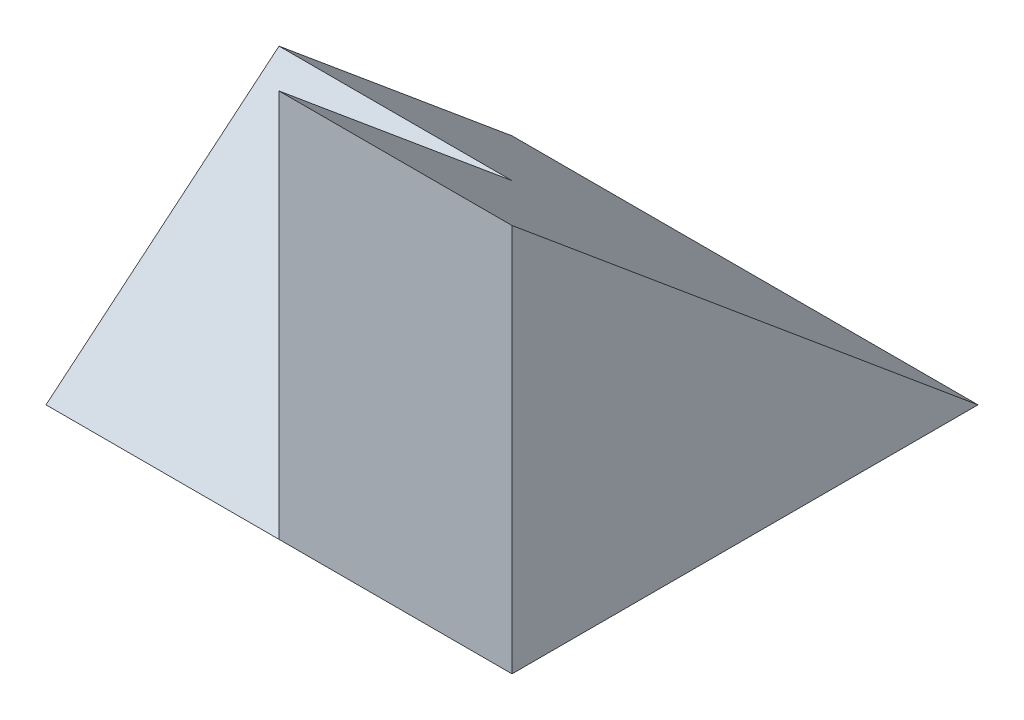
ISO-10303-21;
HEADER;
FILE_DESCRIPTION(('STEP AP214'),'2;1');
FILE_NAME('part.step','',(''),(''),'','','');
FILE_SCHEMA(('AUTOMOTIVE_DESIGN { 1 0 10303 214 1 1 1 1 }'));
ENDSEC;
DATA;
#1=APPLICATION_CONTEXT('core data for automotive mechanical design processes');
#2=APPLICATION_PROTOCOL_DEFINITION('international standard','automotive_design',2000,#1);
#3=PRODUCT_CONTEXT('',#1,'mechanical');
#4=PRODUCT('Part','Part','',(#3));
#5=PRODUCT_RELATED_PRODUCT_CATEGORY('part','',(#4));
#6=PRODUCT_DEFINITION_FORMATION('','',#4);
#7=PRODUCT_DEFINITION_CONTEXT('part definition',#1,'design');
#8=PRODUCT_DEFINITION('design','',#6,#7);
#9=PRODUCT_DEFINITION_SHAPE('','',#8);
#10=(LENGTH_UNIT() NAMED_UNIT(*) SI_UNIT(.MILLI.,.METRE.));
#11=(NAMED_UNIT(*) PLANE_ANGLE_UNIT() SI_UNIT($,.RADIAN.));
#12=(NAMED_UNIT(*) SI_UNIT($,.STERADIAN.) SOLID_ANGLE_UNIT());
#13=UNCERTAINTY_MEASURE_WITH_UNIT(LENGTH_MEASURE(1.E-05),#10,'distance_accuracy_value','');
#14=(GEOMETRIC_REPRESENTATION_CONTEXT(3) GLOBAL_UNCERTAINTY_ASSIGNED_CONTEXT((#13)) GLOBAL_UNIT_ASSIGNED_CONTEXT((#10,
#11,#12)) REPRESENTATION_CONTEXT('',''));
#15=CARTESIAN_POINT('',(0.,0.,0.));
#16=DIRECTION('',(0.,0.,1.));
#17=DIRECTION('',(1.,0.,0.));
#18=AXIS2_PLACEMENT_3D('',#15,#16,#17);
#19=CARTESIAN_POINT('',(-3.,5.,3.));
#20=DIRECTION('',(0.,0.,-1.));
#21=DIRECTION('',(-1.,0.,0.));
#22=AXIS2_PLACEMENT_3D('',#19,#20,#21);
#23=PLANE('',#22);
#24=DIRECTION('',(0.,1.,0.));
#25=VECTOR('',#24,1.);
#26=CARTESIAN_POINT('',(0.,0.,3.));
#27=LINE('',#26,#25);
#28=CARTESIAN_POINT('',(0.,0.,3.));
#29=VERTEX_POINT('',#28);
#30=CARTESIAN_POINT('',(0.,5.,3.));
#31=VERTEX_POINT('',#30);
#32=EDGE_CURVE('E48',#29,#31,#27,.T.);
#33=ORIENTED_EDGE('',*,*,#32,.F.);
#34=DIRECTION('',(1.,0.,0.));
#35=VECTOR('',#34,1.);
#36=CARTESIAN_POINT('',(-3.,0.,3.));
#37=LINE('',#36,#35);
#38=CARTESIAN_POINT('',(3.,0.,3.));
#39=VERTEX_POINT('',#38);
#40=EDGE_CURVE('E55',#29,#39,#37,.T.);
#41=ORIENTED_EDGE('',*,*,#40,.T.);
#42=DIRECTION('',(0.,-1.,0.));
#43=VECTOR('',#42,1.);
#44=CARTESIAN_POINT('',(3.,5.,3.));
#45=LINE('',#44,#43);
#46=CARTESIAN_POINT('',(3.,5.,3.));
#47=VERTEX_POINT('',#46);
#48=EDGE_CURVE('E11',#47,#39,#45,.T.);
#49=ORIENTED_EDGE('',*,*,#48,.F.);
#50=DIRECTION('',(1.,0.,0.));
#51=VECTOR('',#50,1.);
#52=CARTESIAN_POINT('',(-3.,5.,3.));
#53=LINE('',#52,#51);
#54=EDGE_CURVE('E41',#31,#47,#53,.T.);
#55=ORIENTED_EDGE('',*,*,#54,.F.);
#56=EDGE_LOOP('',(#33,#41,#49,#55));
#57=FACE_BOUND('',#56,.T.);
#58=ADVANCED_FACE('F33',(#57),#23,.F.);
#59=CARTESIAN_POINT('',(3.,5.,3.));
#60=DIRECTION('',(-1.,0.,0.));
#61=DIRECTION('',(0.,0.,1.));
#62=AXIS2_PLACEMENT_3D('',#59,#60,#61);
#63=PLANE('',#62);
#64=DIRECTION('',(0.,0.,-1.));
#65=VECTOR('',#64,1.);
#66=CARTESIAN_POINT('',(3.,0.,3.));
#67=LINE('',#66,#65);
#68=CARTESIAN_POINT('',(3.,0.,-3.));
#69=VERTEX_POINT('',#68);
#70=EDGE_CURVE('E103',#39,#69,#67,.T.);
#71=ORIENTED_EDGE('',*,*,#70,.T.);
#72=DIRECTION('',(0.,0.64018439966448,0.768221279597376));
#73=VECTOR('',#72,1.);
#74=CARTESIAN_POINT('',(3.,5.,3.));
#75=LINE('',#74,#73);
#76=EDGE_CURVE('E96',#69,#47,#75,.T.);
#77=ORIENTED_EDGE('',*,*,#76,.T.);
#78=ORIENTED_EDGE('',*,*,#48,.T.);
#79=EDGE_LOOP('',(#71,#77,#78));
#80=FACE_BOUND('',#79,.T.);
#81=ADVANCED_FACE('F35',(#80),#63,.F.);
#82=CARTESIAN_POINT('',(-3.,5.,3.));
#83=DIRECTION('',(1.,0.,0.));
#84=DIRECTION('',(0.,0.,-1.));
#85=AXIS2_PLACEMENT_3D('',#82,#83,#84);
#86=PLANE('',#85);
#87=DIRECTION('',(0.,0.,1.));
#88=VECTOR('',#87,1.);
#89=CARTESIAN_POINT('',(-3.,0.,3.));
#90=LINE('',#89,#88);
#91=CARTESIAN_POINT('',(-3.,0.,-3.));
#92=VERTEX_POINT('',#91);
#93=CARTESIAN_POINT('',(-3.,0.,3.));
#94=VERTEX_POINT('',#93);
#95=EDGE_CURVE('E109',#92,#94,#90,.T.);
#96=ORIENTED_EDGE('',*,*,#95,.T.);
#97=DIRECTION('',(0.,-0.64018439966448,0.768221279597376));
#98=VECTOR('',#97,1.);
#99=CARTESIAN_POINT('',(-3.,1.47540983606557,1.22950819672131));
#100=LINE('',#99,#98);
#101=CARTESIAN_POINT('',(-3.,2.5,0.));
#102=VERTEX_POINT('',#101);
#103=EDGE_CURVE('E89',#102,#94,#100,.T.);
#104=ORIENTED_EDGE('',*,*,#103,.F.);
#105=DIRECTION('',(0.,0.64018439966448,0.768221279597376));
#106=VECTOR('',#105,1.);
#107=CARTESIAN_POINT('',(-3.,1.47540983606557,-1.22950819672131));
#108=LINE('',#107,#106);
#109=EDGE_CURVE('E94',#92,#102,#108,.T.);
#110=ORIENTED_EDGE('',*,*,#109,.F.);
#111=EDGE_LOOP('',(#96,#104,#110));
#112=FACE_BOUND('',#111,.T.);
#113=ADVANCED_FACE('F113',(#112),#86,.F.);
#114=CARTESIAN_POINT('',(0.,0.,0.));
#115=DIRECTION('',(0.,-1.,0.));
#116=DIRECTION('',(0.,0.,-1.));
#117=AXIS2_PLACEMENT_3D('',#114,#115,#116);
#118=PLANE('',#117);
#119=ORIENTED_EDGE('',*,*,#70,.F.);
#120=ORIENTED_EDGE('',*,*,#40,.F.);
#121=EDGE_CURVE('E83',#94,#29,#37,.T.);
#122=ORIENTED_EDGE('',*,*,#121,.F.);
#123=ORIENTED_EDGE('',*,*,#95,.F.);
#124=DIRECTION('',(-1.,0.,0.));
#125=VECTOR('',#124,1.);
#126=CARTESIAN_POINT('',(-3.,0.,-3.));
#127=LINE('',#126,#125);
#128=EDGE_CURVE('E107',#69,#92,#127,.T.);
#129=ORIENTED_EDGE('',*,*,#128,.F.);
#130=EDGE_LOOP('',(#119,#120,#122,#123,#129));
#131=FACE_BOUND('',#130,.T.);
#132=ADVANCED_FACE('F117',(#131),#118,.T.);
#133=CARTESIAN_POINT('',(20.5,1.47540983606557,-1.22950819672131));
#134=DIRECTION('',(0.,-0.768221279597376,0.64018439966448));
#135=DIRECTION('',(0.,-0.64018439966448,-0.768221279597376));
#136=AXIS2_PLACEMENT_3D('',#133,#134,#135);
#137=PLANE('',#136);
#138=ORIENTED_EDGE('',*,*,#109,.T.);
#139=DIRECTION('',(-1.,0.,0.));
#140=VECTOR('',#139,1.);
#141=CARTESIAN_POINT('',(0.,2.5,0.));
#142=LINE('',#141,#140);
#143=CARTESIAN_POINT('',(0.,2.5,0.));
#144=VERTEX_POINT('',#143);
#145=EDGE_CURVE('E80',#144,#102,#142,.T.);
#146=ORIENTED_EDGE('',*,*,#145,.F.);
#147=DIRECTION('',(0.,-0.64018439966448,-0.768221279597376));
#148=VECTOR('',#147,1.);
#149=CARTESIAN_POINT('',(0.,1.47540983606557,-1.22950819672131));
#150=LINE('',#149,#148);
#151=EDGE_CURVE('E84',#31,#144,#150,.T.);
#152=ORIENTED_EDGE('',*,*,#151,.F.);
#153=ORIENTED_EDGE('',*,*,#54,.T.);
#154=ORIENTED_EDGE('',*,*,#76,.F.);
#155=ORIENTED_EDGE('',*,*,#128,.T.);
#156=EDGE_LOOP('',(#138,#146,#152,#153,#154,#155));
#157=FACE_BOUND('',#156,.T.);
#158=ADVANCED_FACE('F92',(#157),#137,.F.);
#159=CARTESIAN_POINT('',(0.,1.47540983606557,1.22950819672131));
#160=DIRECTION('',(0.,-0.768221279597376,-0.64018439966448));
#161=DIRECTION('',(0.,0.64018439966448,-0.768221279597376));
#162=AXIS2_PLACEMENT_3D('',#159,#160,#161);
#163=PLANE('',#162);
#164=ORIENTED_EDGE('',*,*,#103,.T.);
#165=ORIENTED_EDGE('',*,*,#121,.T.);
#166=DIRECTION('',(0.,-0.64018439966448,0.768221279597376));
#167=VECTOR('',#166,1.);
#168=CARTESIAN_POINT('',(0.,1.47540983606557,1.22950819672131));
#169=LINE('',#168,#167);
#170=EDGE_CURVE('E77',#144,#29,#169,.T.);
#171=ORIENTED_EDGE('',*,*,#170,.F.);
#172=ORIENTED_EDGE('',*,*,#145,.T.);
#173=EDGE_LOOP('',(#164,#165,#171,#172));
#174=FACE_BOUND('',#173,.T.);
#175=ADVANCED_FACE('F78',(#174),#163,.F.);
#176=CARTESIAN_POINT('',(0.,0.,0.));
#177=DIRECTION('',(-1.,0.,0.));
#178=DIRECTION('',(0.,0.,1.));
#179=AXIS2_PLACEMENT_3D('',#176,#177,#178);
#180=PLANE('',#179);
#181=ORIENTED_EDGE('',*,*,#151,.T.);
#182=ORIENTED_EDGE('',*,*,#170,.T.);
#183=ORIENTED_EDGE('',*,*,#32,.T.);
#184=EDGE_LOOP('',(#181,#182,#183));
#185=FACE_BOUND('',#184,.T.);
#186=ADVANCED_FACE('F86',(#185),#180,.T.);
#187=CLOSED_SHELL('',(#58,#81,#113,#132,#158,#175,#186));
#188=MANIFOLD_SOLID_BREP('B2',#187);
#189=ADVANCED_BREP_SHAPE_REPRESENTATION('',(#18,#188),#14);
#190=SHAPE_DEFINITION_REPRESENTATION(#9,#189);
ENDSEC;
END-ISO-10303-21;
